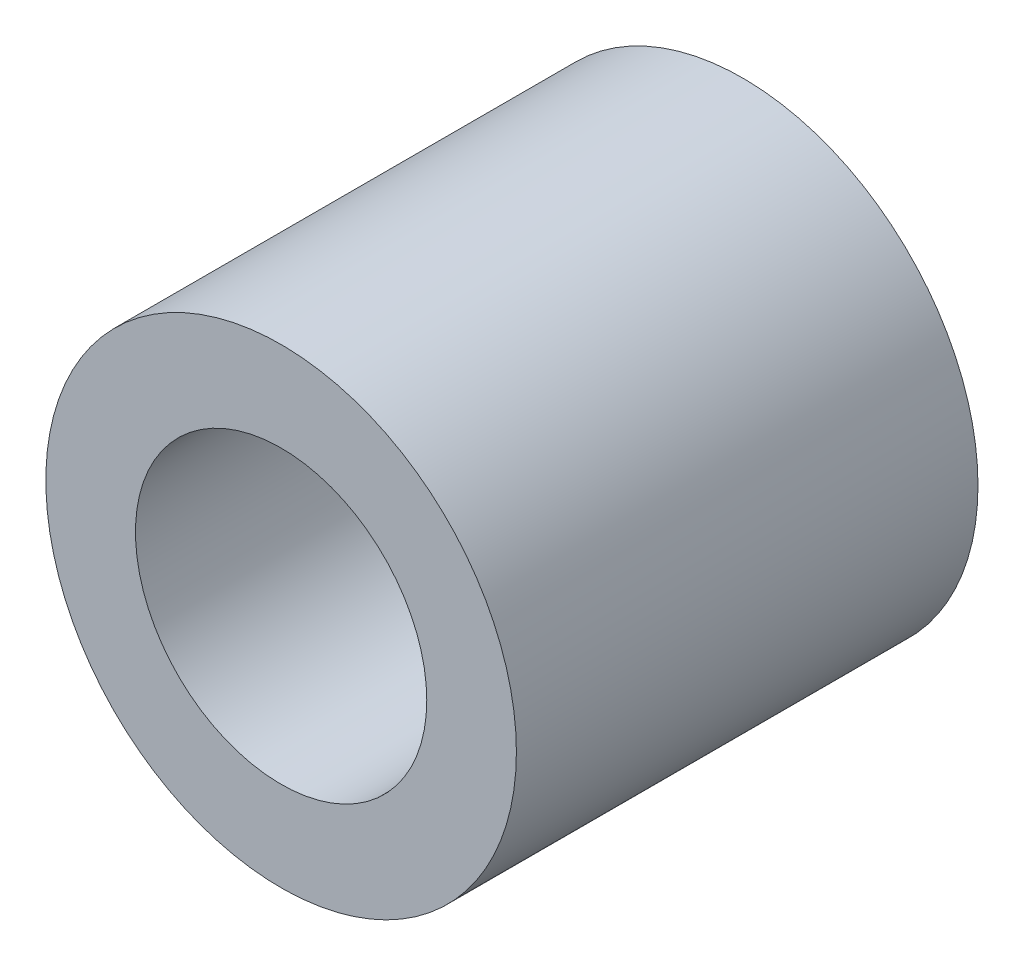
ISO-10303-21;
HEADER;
FILE_DESCRIPTION(('STEP AP214'),'2;1');
FILE_NAME('part.step','',(''),(''),'','','');
FILE_SCHEMA(('AUTOMOTIVE_DESIGN { 1 0 10303 214 1 1 1 1 }'));
ENDSEC;
DATA;
#1=APPLICATION_CONTEXT('core data for automotive mechanical design processes');
#2=APPLICATION_PROTOCOL_DEFINITION('international standard','automotive_design',2000,#1);
#3=PRODUCT_CONTEXT('',#1,'mechanical');
#4=PRODUCT('Part','Part','',(#3));
#5=PRODUCT_RELATED_PRODUCT_CATEGORY('part','',(#4));
#6=PRODUCT_DEFINITION_FORMATION('','',#4);
#7=PRODUCT_DEFINITION_CONTEXT('part definition',#1,'design');
#8=PRODUCT_DEFINITION('design','',#6,#7);
#9=PRODUCT_DEFINITION_SHAPE('','',#8);
#10=(LENGTH_UNIT() NAMED_UNIT(*) SI_UNIT(.MILLI.,.METRE.));
#11=(NAMED_UNIT(*) PLANE_ANGLE_UNIT() SI_UNIT($,.RADIAN.));
#12=(NAMED_UNIT(*) SI_UNIT($,.STERADIAN.) SOLID_ANGLE_UNIT());
#13=UNCERTAINTY_MEASURE_WITH_UNIT(LENGTH_MEASURE(1.E-05),#10,'distance_accuracy_value','');
#14=(GEOMETRIC_REPRESENTATION_CONTEXT(3) GLOBAL_UNCERTAINTY_ASSIGNED_CONTEXT((#13)) GLOBAL_UNIT_ASSIGNED_CONTEXT((#10,
#11,#12)) REPRESENTATION_CONTEXT('',''));
#15=CARTESIAN_POINT('',(0.,0.,0.));
#16=DIRECTION('',(0.,0.,1.));
#17=DIRECTION('',(1.,0.,0.));
#18=AXIS2_PLACEMENT_3D('',#15,#16,#17);
#19=CARTESIAN_POINT('',(0.,0.,10.3));
#20=DIRECTION('',(0.,0.,1.));
#21=DIRECTION('',(1.,0.,0.));
#22=AXIS2_PLACEMENT_3D('',#19,#20,#21);
#23=PLANE('',#22);
#24=CARTESIAN_POINT('',(0.,0.,10.3));
#25=DIRECTION('',(0.,0.,1.));
#26=DIRECTION('',(1.,0.,0.));
#27=AXIS2_PLACEMENT_3D('',#24,#25,#26);
#28=CIRCLE('',#27,5.25);
#29=CARTESIAN_POINT('',(5.25,0.,10.3));
#30=VERTEX_POINT('',#29);
#31=EDGE_CURVE('E10',#30,#30,#28,.T.);
#32=ORIENTED_EDGE('',*,*,#31,.T.);
#33=EDGE_LOOP('',(#32));
#34=FACE_BOUND('',#33,.T.);
#35=CARTESIAN_POINT('',(0.,0.,10.3));
#36=DIRECTION('',(0.,0.,1.));
#37=DIRECTION('',(1.,0.,0.));
#38=AXIS2_PLACEMENT_3D('',#35,#36,#37);
#39=CIRCLE('',#38,3.25);
#40=CARTESIAN_POINT('',(3.25,0.,10.3));
#41=VERTEX_POINT('',#40);
#42=EDGE_CURVE('E44',#41,#41,#39,.T.);
#43=ORIENTED_EDGE('',*,*,#42,.F.);
#44=EDGE_LOOP('',(#43));
#45=FACE_BOUND('',#44,.T.);
#46=ADVANCED_FACE('F33',(#34,#45),#23,.T.);
#47=CARTESIAN_POINT('',(0.,0.,0.));
#48=DIRECTION('',(0.,0.,1.));
#49=DIRECTION('',(1.,0.,0.));
#50=AXIS2_PLACEMENT_3D('',#47,#48,#49);
#51=PLANE('',#50);
#52=CARTESIAN_POINT('',(0.,0.,0.));
#53=DIRECTION('',(0.,0.,1.));
#54=DIRECTION('',(1.,0.,0.));
#55=AXIS2_PLACEMENT_3D('',#52,#53,#54);
#56=CIRCLE('',#55,5.25);
#57=CARTESIAN_POINT('',(5.25,0.,0.));
#58=VERTEX_POINT('',#57);
#59=EDGE_CURVE('E37',#58,#58,#56,.T.);
#60=ORIENTED_EDGE('',*,*,#59,.F.);
#61=EDGE_LOOP('',(#60));
#62=FACE_BOUND('',#61,.T.);
#63=CARTESIAN_POINT('',(0.,0.,0.));
#64=DIRECTION('',(0.,0.,1.));
#65=DIRECTION('',(1.,0.,0.));
#66=AXIS2_PLACEMENT_3D('',#63,#64,#65);
#67=CIRCLE('',#66,3.25);
#68=CARTESIAN_POINT('',(3.25,0.,0.));
#69=VERTEX_POINT('',#68);
#70=EDGE_CURVE('E46',#69,#69,#67,.T.);
#71=ORIENTED_EDGE('',*,*,#70,.T.);
#72=EDGE_LOOP('',(#71));
#73=FACE_BOUND('',#72,.T.);
#74=ADVANCED_FACE('F56',(#62,#73),#51,.F.);
#75=CARTESIAN_POINT('',(0.,0.,10.3));
#76=DIRECTION('',(0.,0.,-1.));
#77=DIRECTION('',(-1.,0.,0.));
#78=AXIS2_PLACEMENT_3D('',#75,#76,#77);
#79=CYLINDRICAL_SURFACE('',#78,5.25);
#80=ORIENTED_EDGE('',*,*,#31,.F.);
#81=EDGE_LOOP('',(#80));
#82=FACE_BOUND('',#81,.T.);
#83=ORIENTED_EDGE('',*,*,#59,.T.);
#84=EDGE_LOOP('',(#83));
#85=FACE_BOUND('',#84,.T.);
#86=ADVANCED_FACE('F35',(#82,#85),#79,.T.);
#87=CARTESIAN_POINT('',(0.,0.,10.3));
#88=DIRECTION('',(0.,0.,-1.));
#89=DIRECTION('',(-1.,0.,0.));
#90=AXIS2_PLACEMENT_3D('',#87,#88,#89);
#91=CYLINDRICAL_SURFACE('',#90,3.25);
#92=ORIENTED_EDGE('',*,*,#42,.T.);
#93=EDGE_LOOP('',(#92));
#94=FACE_BOUND('',#93,.T.);
#95=ORIENTED_EDGE('',*,*,#70,.F.);
#96=EDGE_LOOP('',(#95));
#97=FACE_BOUND('',#96,.T.);
#98=ADVANCED_FACE('F52',(#94,#97),#91,.F.);
#99=CLOSED_SHELL('',(#46,#74,#86,#98));
#100=MANIFOLD_SOLID_BREP('B2',#99);
#101=ADVANCED_BREP_SHAPE_REPRESENTATION('',(#18,#100),#14);
#102=SHAPE_DEFINITION_REPRESENTATION(#9,#101);
ENDSEC;
END-ISO-10303-21;
